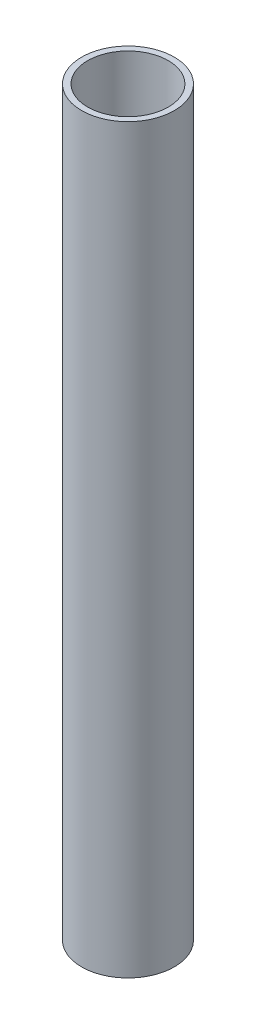
ISO-10303-21;
HEADER;
FILE_DESCRIPTION(('STEP AP214'),'2;1');
FILE_NAME('part.step','',(''),(''),'','','');
FILE_SCHEMA(('AUTOMOTIVE_DESIGN { 1 0 10303 214 1 1 1 1 }'));
ENDSEC;
DATA;
#1=APPLICATION_CONTEXT('core data for automotive mechanical design processes');
#2=APPLICATION_PROTOCOL_DEFINITION('international standard','automotive_design',2000,#1);
#3=PRODUCT_CONTEXT('',#1,'mechanical');
#4=PRODUCT('Part','Part','',(#3));
#5=PRODUCT_RELATED_PRODUCT_CATEGORY('part','',(#4));
#6=PRODUCT_DEFINITION_FORMATION('','',#4);
#7=PRODUCT_DEFINITION_CONTEXT('part definition',#1,'design');
#8=PRODUCT_DEFINITION('design','',#6,#7);
#9=PRODUCT_DEFINITION_SHAPE('','',#8);
#10=(LENGTH_UNIT() NAMED_UNIT(*) SI_UNIT(.MILLI.,.METRE.));
#11=(NAMED_UNIT(*) PLANE_ANGLE_UNIT() SI_UNIT($,.RADIAN.));
#12=(NAMED_UNIT(*) SI_UNIT($,.STERADIAN.) SOLID_ANGLE_UNIT());
#13=UNCERTAINTY_MEASURE_WITH_UNIT(LENGTH_MEASURE(1.E-05),#10,'distance_accuracy_value','');
#14=(GEOMETRIC_REPRESENTATION_CONTEXT(3) GLOBAL_UNCERTAINTY_ASSIGNED_CONTEXT((#13)) GLOBAL_UNIT_ASSIGNED_CONTEXT((#10,
#11,#12)) REPRESENTATION_CONTEXT('',''));
#15=CARTESIAN_POINT('',(0.,0.,0.));
#16=DIRECTION('',(0.,0.,1.));
#17=DIRECTION('',(1.,0.,0.));
#18=AXIS2_PLACEMENT_3D('',#15,#16,#17);
#19=CARTESIAN_POINT('',(0.,152.4,0.));
#20=DIRECTION('',(0.,1.,0.));
#21=DIRECTION('',(0.,0.,1.));
#22=AXIS2_PLACEMENT_3D('',#19,#20,#21);
#23=PLANE('',#22);
#24=CARTESIAN_POINT('',(0.,152.4,0.));
#25=DIRECTION('',(0.,1.,0.));
#26=DIRECTION('',(0.,0.,1.));
#27=AXIS2_PLACEMENT_3D('',#24,#25,#26);
#28=CIRCLE('',#27,9.525);
#29=CARTESIAN_POINT('',(0.,152.4,9.525));
#30=VERTEX_POINT('',#29);
#31=EDGE_CURVE('E10',#30,#30,#28,.T.);
#32=ORIENTED_EDGE('',*,*,#31,.T.);
#33=EDGE_LOOP('',(#32));
#34=FACE_BOUND('',#33,.T.);
#35=CARTESIAN_POINT('',(0.,152.4,0.));
#36=DIRECTION('',(0.,1.,0.));
#37=DIRECTION('',(0.,0.,1.));
#38=AXIS2_PLACEMENT_3D('',#35,#36,#37);
#39=CIRCLE('',#38,8.2804);
#40=CARTESIAN_POINT('',(0.,152.4,8.2804));
#41=VERTEX_POINT('',#40);
#42=EDGE_CURVE('E44',#41,#41,#39,.T.);
#43=ORIENTED_EDGE('',*,*,#42,.F.);
#44=EDGE_LOOP('',(#43));
#45=FACE_BOUND('',#44,.T.);
#46=ADVANCED_FACE('F33',(#34,#45),#23,.T.);
#47=CARTESIAN_POINT('',(0.,0.,0.));
#48=DIRECTION('',(0.,1.,0.));
#49=DIRECTION('',(0.,0.,1.));
#50=AXIS2_PLACEMENT_3D('',#47,#48,#49);
#51=PLANE('',#50);
#52=CARTESIAN_POINT('',(0.,0.,0.));
#53=DIRECTION('',(0.,1.,0.));
#54=DIRECTION('',(0.,0.,1.));
#55=AXIS2_PLACEMENT_3D('',#52,#53,#54);
#56=CIRCLE('',#55,9.525);
#57=CARTESIAN_POINT('',(0.,0.,9.525));
#58=VERTEX_POINT('',#57);
#59=EDGE_CURVE('E37',#58,#58,#56,.T.);
#60=ORIENTED_EDGE('',*,*,#59,.F.);
#61=EDGE_LOOP('',(#60));
#62=FACE_BOUND('',#61,.T.);
#63=CARTESIAN_POINT('',(0.,0.,0.));
#64=DIRECTION('',(0.,1.,0.));
#65=DIRECTION('',(0.,0.,1.));
#66=AXIS2_PLACEMENT_3D('',#63,#64,#65);
#67=CIRCLE('',#66,8.2804);
#68=CARTESIAN_POINT('',(0.,0.,8.2804));
#69=VERTEX_POINT('',#68);
#70=EDGE_CURVE('E46',#69,#69,#67,.T.);
#71=ORIENTED_EDGE('',*,*,#70,.T.);
#72=EDGE_LOOP('',(#71));
#73=FACE_BOUND('',#72,.T.);
#74=ADVANCED_FACE('F56',(#62,#73),#51,.F.);
#75=CARTESIAN_POINT('',(0.,152.4,0.));
#76=DIRECTION('',(0.,-1.,0.));
#77=DIRECTION('',(0.,0.,-1.));
#78=AXIS2_PLACEMENT_3D('',#75,#76,#77);
#79=CYLINDRICAL_SURFACE('',#78,9.525);
#80=ORIENTED_EDGE('',*,*,#31,.F.);
#81=EDGE_LOOP('',(#80));
#82=FACE_BOUND('',#81,.T.);
#83=ORIENTED_EDGE('',*,*,#59,.T.);
#84=EDGE_LOOP('',(#83));
#85=FACE_BOUND('',#84,.T.);
#86=ADVANCED_FACE('F35',(#82,#85),#79,.T.);
#87=CARTESIAN_POINT('',(0.,152.4,0.));
#88=DIRECTION('',(0.,-1.,0.));
#89=DIRECTION('',(0.,0.,-1.));
#90=AXIS2_PLACEMENT_3D('',#87,#88,#89);
#91=CYLINDRICAL_SURFACE('',#90,8.2804);
#92=ORIENTED_EDGE('',*,*,#42,.T.);
#93=EDGE_LOOP('',(#92));
#94=FACE_BOUND('',#93,.T.);
#95=ORIENTED_EDGE('',*,*,#70,.F.);
#96=EDGE_LOOP('',(#95));
#97=FACE_BOUND('',#96,.T.);
#98=ADVANCED_FACE('F52',(#94,#97),#91,.F.);
#99=CLOSED_SHELL('',(#46,#74,#86,#98));
#100=MANIFOLD_SOLID_BREP('B2',#99);
#101=ADVANCED_BREP_SHAPE_REPRESENTATION('',(#18,#100),#14);
#102=SHAPE_DEFINITION_REPRESENTATION(#9,#101);
ENDSEC;
END-ISO-10303-21;
